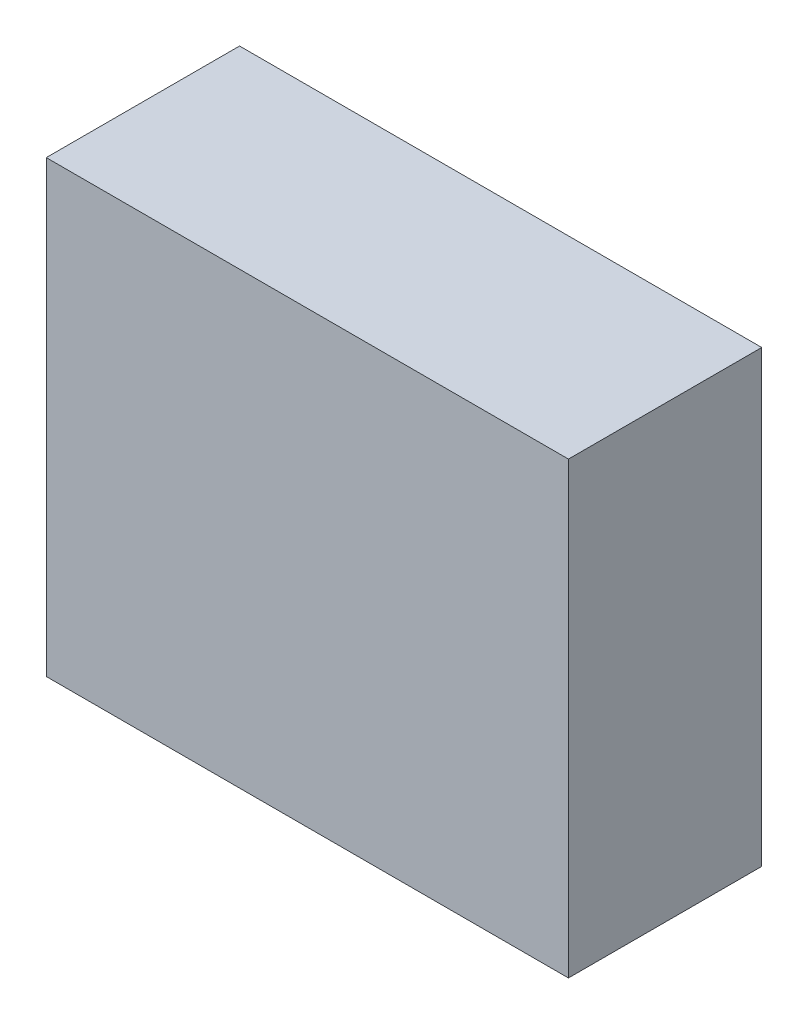
ISO-10303-21;
HEADER;
FILE_DESCRIPTION(('STEP AP214'),'2;1');
FILE_NAME('part.step','',(''),(''),'','','');
FILE_SCHEMA(('AUTOMOTIVE_DESIGN { 1 0 10303 214 1 1 1 1 }'));
ENDSEC;
DATA;
#1=APPLICATION_CONTEXT('core data for automotive mechanical design processes');
#2=APPLICATION_PROTOCOL_DEFINITION('international standard','automotive_design',2000,#1);
#3=PRODUCT_CONTEXT('',#1,'mechanical');
#4=PRODUCT('Part','Part','',(#3));
#5=PRODUCT_RELATED_PRODUCT_CATEGORY('part','',(#4));
#6=PRODUCT_DEFINITION_FORMATION('','',#4);
#7=PRODUCT_DEFINITION_CONTEXT('part definition',#1,'design');
#8=PRODUCT_DEFINITION('design','',#6,#7);
#9=PRODUCT_DEFINITION_SHAPE('','',#8);
#10=(LENGTH_UNIT() NAMED_UNIT(*) SI_UNIT(.MILLI.,.METRE.));
#11=(NAMED_UNIT(*) PLANE_ANGLE_UNIT() SI_UNIT($,.RADIAN.));
#12=(NAMED_UNIT(*) SI_UNIT($,.STERADIAN.) SOLID_ANGLE_UNIT());
#13=UNCERTAINTY_MEASURE_WITH_UNIT(LENGTH_MEASURE(1.E-05),#10,'distance_accuracy_value','');
#14=(GEOMETRIC_REPRESENTATION_CONTEXT(3) GLOBAL_UNCERTAINTY_ASSIGNED_CONTEXT((#13)) GLOBAL_UNIT_ASSIGNED_CONTEXT((#10,
#11,#12)) REPRESENTATION_CONTEXT('',''));
#15=CARTESIAN_POINT('',(0.,0.,0.));
#16=DIRECTION('',(0.,0.,1.));
#17=DIRECTION('',(1.,0.,0.));
#18=AXIS2_PLACEMENT_3D('',#15,#16,#17);
#19=CARTESIAN_POINT('',(-32.4551113756812,-19.7838708385828,20.));
#20=DIRECTION('',(1.,0.,0.));
#21=DIRECTION('',(0.,0.,-1.));
#22=AXIS2_PLACEMENT_3D('',#19,#20,#21);
#23=PLANE('',#22);
#24=DIRECTION('',(0.,-1.,0.));
#25=VECTOR('',#24,1.);
#26=CARTESIAN_POINT('',(-32.4551113756812,-19.7838708385828,0.));
#27=LINE('',#26,#25);
#28=CARTESIAN_POINT('',(-32.4551113756812,26.7171911324668,0.));
#29=VERTEX_POINT('',#28);
#30=CARTESIAN_POINT('',(-32.4551113756812,-19.7838708385828,0.));
#31=VERTEX_POINT('',#30);
#32=EDGE_CURVE('E102',#29,#31,#27,.T.);
#33=ORIENTED_EDGE('',*,*,#32,.T.);
#34=DIRECTION('',(0.,0.,-1.));
#35=VECTOR('',#34,1.);
#36=CARTESIAN_POINT('',(-32.4551113756812,-19.7838708385828,20.));
#37=LINE('',#36,#35);
#38=CARTESIAN_POINT('',(-32.4551113756812,-19.7838708385828,20.));
#39=VERTEX_POINT('',#38);
#40=EDGE_CURVE('E11',#39,#31,#37,.T.);
#41=ORIENTED_EDGE('',*,*,#40,.F.);
#42=DIRECTION('',(0.,-1.,0.));
#43=VECTOR('',#42,1.);
#44=CARTESIAN_POINT('',(-32.4551113756812,-19.7838708385828,20.));
#45=LINE('',#44,#43);
#46=CARTESIAN_POINT('',(-32.4551113756812,26.7171911324668,20.));
#47=VERTEX_POINT('',#46);
#48=EDGE_CURVE('E90',#47,#39,#45,.T.);
#49=ORIENTED_EDGE('',*,*,#48,.F.);
#50=DIRECTION('',(0.,0.,-1.));
#51=VECTOR('',#50,1.);
#52=CARTESIAN_POINT('',(-32.4551113756812,26.7171911324668,20.));
#53=LINE('',#52,#51);
#54=EDGE_CURVE('E98',#47,#29,#53,.T.);
#55=ORIENTED_EDGE('',*,*,#54,.T.);
#56=EDGE_LOOP('',(#33,#41,#49,#55));
#57=FACE_BOUND('',#56,.T.);
#58=ADVANCED_FACE('F39',(#57),#23,.F.);
#59=CARTESIAN_POINT('',(-32.4551113756812,-19.7838708385828,20.));
#60=DIRECTION('',(0.,1.,0.));
#61=DIRECTION('',(0.,0.,1.));
#62=AXIS2_PLACEMENT_3D('',#59,#60,#61);
#63=PLANE('',#62);
#64=DIRECTION('',(1.,0.,0.));
#65=VECTOR('',#64,1.);
#66=CARTESIAN_POINT('',(-32.4551113756812,-19.7838708385828,0.));
#67=LINE('',#66,#65);
#68=CARTESIAN_POINT('',(21.5769709145873,-19.7838708385828,0.));
#69=VERTEX_POINT('',#68);
#70=EDGE_CURVE('E94',#31,#69,#67,.T.);
#71=ORIENTED_EDGE('',*,*,#70,.T.);
#72=DIRECTION('',(0.,0.,-1.));
#73=VECTOR('',#72,1.);
#74=CARTESIAN_POINT('',(21.5769709145873,-19.7838708385828,20.));
#75=LINE('',#74,#73);
#76=CARTESIAN_POINT('',(21.5769709145873,-19.7838708385828,20.));
#77=VERTEX_POINT('',#76);
#78=EDGE_CURVE('E47',#77,#69,#75,.T.);
#79=ORIENTED_EDGE('',*,*,#78,.F.);
#80=DIRECTION('',(1.,0.,0.));
#81=VECTOR('',#80,1.);
#82=CARTESIAN_POINT('',(-32.4551113756812,-19.7838708385828,20.));
#83=LINE('',#82,#81);
#84=EDGE_CURVE('E85',#39,#77,#83,.T.);
#85=ORIENTED_EDGE('',*,*,#84,.F.);
#86=ORIENTED_EDGE('',*,*,#40,.T.);
#87=EDGE_LOOP('',(#71,#79,#85,#86));
#88=FACE_BOUND('',#87,.T.);
#89=ADVANCED_FACE('F93',(#88),#63,.F.);
#90=CARTESIAN_POINT('',(21.5769709145873,-19.7838708385828,20.));
#91=DIRECTION('',(-1.,0.,0.));
#92=DIRECTION('',(0.,0.,1.));
#93=AXIS2_PLACEMENT_3D('',#90,#91,#92);
#94=PLANE('',#93);
#95=DIRECTION('',(0.,1.,0.));
#96=VECTOR('',#95,1.);
#97=CARTESIAN_POINT('',(21.5769709145873,-19.7838708385828,0.));
#98=LINE('',#97,#96);
#99=CARTESIAN_POINT('',(21.5769709145873,26.7171911324668,0.));
#100=VERTEX_POINT('',#99);
#101=EDGE_CURVE('E72',#69,#100,#98,.T.);
#102=ORIENTED_EDGE('',*,*,#101,.T.);
#103=DIRECTION('',(0.,0.,-1.));
#104=VECTOR('',#103,1.);
#105=CARTESIAN_POINT('',(21.5769709145873,26.7171911324668,20.));
#106=LINE('',#105,#104);
#107=CARTESIAN_POINT('',(21.5769709145873,26.7171911324668,20.));
#108=VERTEX_POINT('',#107);
#109=EDGE_CURVE('E95',#108,#100,#106,.T.);
#110=ORIENTED_EDGE('',*,*,#109,.F.);
#111=DIRECTION('',(0.,1.,0.));
#112=VECTOR('',#111,1.);
#113=CARTESIAN_POINT('',(21.5769709145873,-19.7838708385828,20.));
#114=LINE('',#113,#112);
#115=EDGE_CURVE('E88',#77,#108,#114,.T.);
#116=ORIENTED_EDGE('',*,*,#115,.F.);
#117=ORIENTED_EDGE('',*,*,#78,.T.);
#118=EDGE_LOOP('',(#102,#110,#116,#117));
#119=FACE_BOUND('',#118,.T.);
#120=ADVANCED_FACE('F96',(#119),#94,.F.);
#121=CARTESIAN_POINT('',(-32.4551113756812,26.7171911324668,20.));
#122=DIRECTION('',(0.,-1.,0.));
#123=DIRECTION('',(0.,0.,-1.));
#124=AXIS2_PLACEMENT_3D('',#121,#122,#123);
#125=PLANE('',#124);
#126=DIRECTION('',(-1.,0.,0.));
#127=VECTOR('',#126,1.);
#128=CARTESIAN_POINT('',(-32.4551113756812,26.7171911324668,0.));
#129=LINE('',#128,#127);
#130=EDGE_CURVE('E78',#100,#29,#129,.T.);
#131=ORIENTED_EDGE('',*,*,#130,.T.);
#132=ORIENTED_EDGE('',*,*,#54,.F.);
#133=DIRECTION('',(-1.,0.,0.));
#134=VECTOR('',#133,1.);
#135=CARTESIAN_POINT('',(-32.4551113756812,26.7171911324668,20.));
#136=LINE('',#135,#134);
#137=EDGE_CURVE('E55',#108,#47,#136,.T.);
#138=ORIENTED_EDGE('',*,*,#137,.F.);
#139=ORIENTED_EDGE('',*,*,#109,.T.);
#140=EDGE_LOOP('',(#131,#132,#138,#139));
#141=FACE_BOUND('',#140,.T.);
#142=ADVANCED_FACE('F109',(#141),#125,.F.);
#143=CARTESIAN_POINT('',(0.,0.,20.));
#144=DIRECTION('',(0.,0.,-1.));
#145=DIRECTION('',(-1.,0.,0.));
#146=AXIS2_PLACEMENT_3D('',#143,#144,#145);
#147=PLANE('',#146);
#148=ORIENTED_EDGE('',*,*,#48,.T.);
#149=ORIENTED_EDGE('',*,*,#84,.T.);
#150=ORIENTED_EDGE('',*,*,#115,.T.);
#151=ORIENTED_EDGE('',*,*,#137,.T.);
#152=EDGE_LOOP('',(#148,#149,#150,#151));
#153=FACE_BOUND('',#152,.T.);
#154=ADVANCED_FACE('F86',(#153),#147,.F.);
#155=CARTESIAN_POINT('',(0.,0.,0.));
#156=DIRECTION('',(0.,0.,-1.));
#157=DIRECTION('',(-1.,0.,0.));
#158=AXIS2_PLACEMENT_3D('',#155,#156,#157);
#159=PLANE('',#158);
#160=ORIENTED_EDGE('',*,*,#32,.F.);
#161=ORIENTED_EDGE('',*,*,#130,.F.);
#162=ORIENTED_EDGE('',*,*,#101,.F.);
#163=ORIENTED_EDGE('',*,*,#70,.F.);
#164=EDGE_LOOP('',(#160,#161,#162,#163));
#165=FACE_BOUND('',#164,.T.);
#166=ADVANCED_FACE('F112',(#165),#159,.T.);
#167=CLOSED_SHELL('',(#58,#89,#120,#142,#154,#166));
#168=MANIFOLD_SOLID_BREP('B2',#167);
#169=ADVANCED_BREP_SHAPE_REPRESENTATION('',(#18,#168),#14);
#170=SHAPE_DEFINITION_REPRESENTATION(#9,#169);
ENDSEC;
END-ISO-10303-21;
